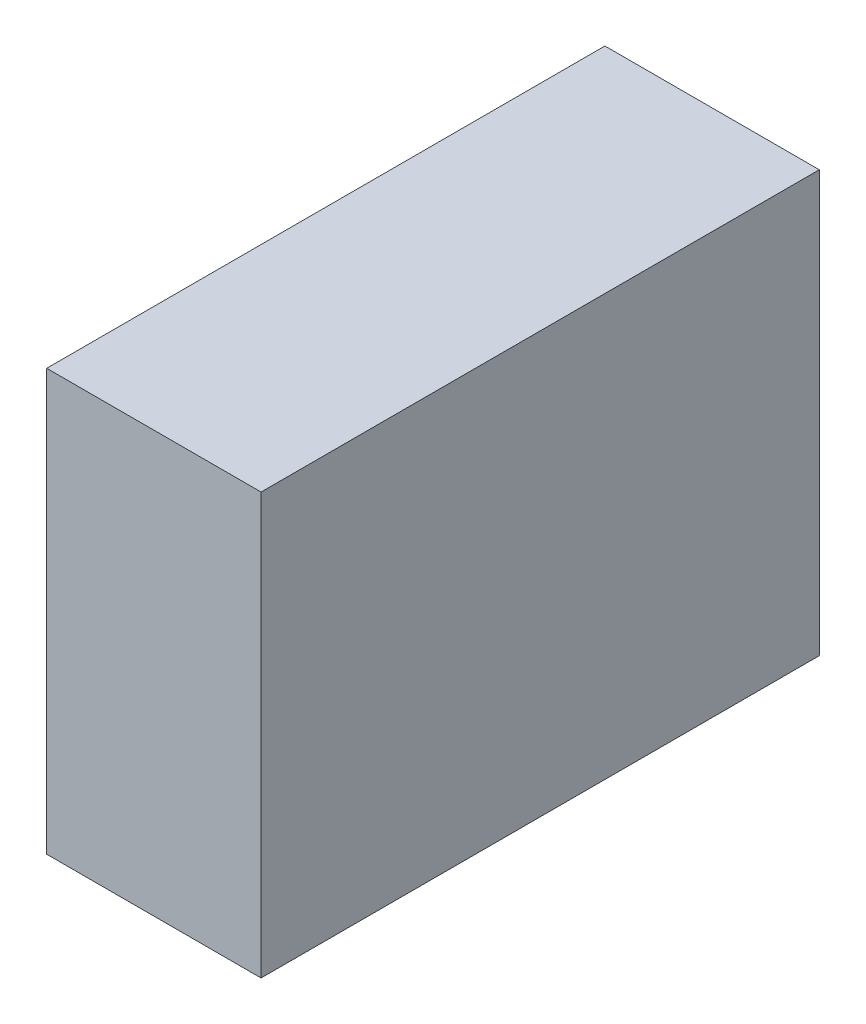
ISO-10303-21;
HEADER;
FILE_DESCRIPTION(('STEP AP214'),'2;1');
FILE_NAME('part.step','',(''),(''),'','','');
FILE_SCHEMA(('AUTOMOTIVE_DESIGN { 1 0 10303 214 1 1 1 1 }'));
ENDSEC;
DATA;
#1=APPLICATION_CONTEXT('core data for automotive mechanical design processes');
#2=APPLICATION_PROTOCOL_DEFINITION('international standard','automotive_design',2000,#1);
#3=PRODUCT_CONTEXT('',#1,'mechanical');
#4=PRODUCT('Part','Part','',(#3));
#5=PRODUCT_RELATED_PRODUCT_CATEGORY('part','',(#4));
#6=PRODUCT_DEFINITION_FORMATION('','',#4);
#7=PRODUCT_DEFINITION_CONTEXT('part definition',#1,'design');
#8=PRODUCT_DEFINITION('design','',#6,#7);
#9=PRODUCT_DEFINITION_SHAPE('','',#8);
#10=(LENGTH_UNIT() NAMED_UNIT(*) SI_UNIT(.MILLI.,.METRE.));
#11=(NAMED_UNIT(*) PLANE_ANGLE_UNIT() SI_UNIT($,.RADIAN.));
#12=(NAMED_UNIT(*) SI_UNIT($,.STERADIAN.) SOLID_ANGLE_UNIT());
#13=UNCERTAINTY_MEASURE_WITH_UNIT(LENGTH_MEASURE(1.E-05),#10,'distance_accuracy_value','');
#14=(GEOMETRIC_REPRESENTATION_CONTEXT(3) GLOBAL_UNCERTAINTY_ASSIGNED_CONTEXT((#13)) GLOBAL_UNIT_ASSIGNED_CONTEXT((#10,
#11,#12)) REPRESENTATION_CONTEXT('',''));
#15=CARTESIAN_POINT('',(0.,0.,0.));
#16=DIRECTION('',(0.,0.,1.));
#17=DIRECTION('',(1.,0.,0.));
#18=AXIS2_PLACEMENT_3D('',#15,#16,#17);
#19=CARTESIAN_POINT('',(0.,0.,25.));
#20=DIRECTION('',(1.,0.,0.));
#21=DIRECTION('',(0.,0.,-1.));
#22=AXIS2_PLACEMENT_3D('',#19,#20,#21);
#23=PLANE('',#22);
#24=DIRECTION('',(0.,-1.,0.));
#25=VECTOR('',#24,1.);
#26=CARTESIAN_POINT('',(0.,0.,0.));
#27=LINE('',#26,#25);
#28=CARTESIAN_POINT('',(0.,18.849,0.));
#29=VERTEX_POINT('',#28);
#30=CARTESIAN_POINT('',(0.,0.,0.));
#31=VERTEX_POINT('',#30);
#32=EDGE_CURVE('E107',#29,#31,#27,.T.);
#33=ORIENTED_EDGE('',*,*,#32,.T.);
#34=DIRECTION('',(0.,0.,-1.));
#35=VECTOR('',#34,1.);
#36=CARTESIAN_POINT('',(0.,0.,25.));
#37=LINE('',#36,#35);
#38=CARTESIAN_POINT('',(0.,0.,25.));
#39=VERTEX_POINT('',#38);
#40=EDGE_CURVE('E11',#39,#31,#37,.T.);
#41=ORIENTED_EDGE('',*,*,#40,.F.);
#42=DIRECTION('',(0.,-1.,0.));
#43=VECTOR('',#42,1.);
#44=CARTESIAN_POINT('',(0.,0.,25.));
#45=LINE('',#44,#43);
#46=CARTESIAN_POINT('',(0.,18.849,25.));
#47=VERTEX_POINT('',#46);
#48=EDGE_CURVE('E91',#47,#39,#45,.T.);
#49=ORIENTED_EDGE('',*,*,#48,.F.);
#50=DIRECTION('',(0.,0.,-1.));
#51=VECTOR('',#50,1.);
#52=CARTESIAN_POINT('',(0.,18.849,25.));
#53=LINE('',#52,#51);
#54=EDGE_CURVE('E103',#47,#29,#53,.T.);
#55=ORIENTED_EDGE('',*,*,#54,.T.);
#56=EDGE_LOOP('',(#33,#41,#49,#55));
#57=FACE_BOUND('',#56,.T.);
#58=ADVANCED_FACE('F39',(#57),#23,.F.);
#59=CARTESIAN_POINT('',(0.,0.,25.));
#60=DIRECTION('',(0.,1.,0.));
#61=DIRECTION('',(-1.,0.,0.));
#62=AXIS2_PLACEMENT_3D('',#59,#60,#61);
#63=PLANE('',#62);
#64=DIRECTION('',(1.,0.,0.));
#65=VECTOR('',#64,1.);
#66=CARTESIAN_POINT('',(0.,0.,0.));
#67=LINE('',#66,#65);
#68=CARTESIAN_POINT('',(9.6,0.,0.));
#69=VERTEX_POINT('',#68);
#70=EDGE_CURVE('E96',#31,#69,#67,.T.);
#71=ORIENTED_EDGE('',*,*,#70,.T.);
#72=DIRECTION('',(0.,0.,-1.));
#73=VECTOR('',#72,1.);
#74=CARTESIAN_POINT('',(9.6,0.,25.));
#75=LINE('',#74,#73);
#76=CARTESIAN_POINT('',(9.6,0.,25.));
#77=VERTEX_POINT('',#76);
#78=EDGE_CURVE('E48',#77,#69,#75,.T.);
#79=ORIENTED_EDGE('',*,*,#78,.F.);
#80=DIRECTION('',(1.,0.,0.));
#81=VECTOR('',#80,1.);
#82=CARTESIAN_POINT('',(0.,0.,25.));
#83=LINE('',#82,#81);
#84=EDGE_CURVE('E86',#39,#77,#83,.T.);
#85=ORIENTED_EDGE('',*,*,#84,.F.);
#86=ORIENTED_EDGE('',*,*,#40,.T.);
#87=EDGE_LOOP('',(#71,#79,#85,#86));
#88=FACE_BOUND('',#87,.T.);
#89=ADVANCED_FACE('F95',(#88),#63,.F.);
#90=CARTESIAN_POINT('',(9.6,0.,25.));
#91=DIRECTION('',(-1.,0.,0.));
#92=DIRECTION('',(0.,-1.,0.));
#93=AXIS2_PLACEMENT_3D('',#90,#91,#92);
#94=PLANE('',#93);
#95=DIRECTION('',(0.,1.,0.));
#96=VECTOR('',#95,1.);
#97=CARTESIAN_POINT('',(9.6,0.,0.));
#98=LINE('',#97,#96);
#99=CARTESIAN_POINT('',(9.59999999999999,18.849,0.));
#100=VERTEX_POINT('',#99);
#101=EDGE_CURVE('E73',#69,#100,#98,.T.);
#102=ORIENTED_EDGE('',*,*,#101,.T.);
#103=DIRECTION('',(0.,0.,-1.));
#104=VECTOR('',#103,1.);
#105=CARTESIAN_POINT('',(9.59999999999999,18.849,25.));
#106=LINE('',#105,#104);
#107=CARTESIAN_POINT('',(9.59999999999999,18.849,25.));
#108=VERTEX_POINT('',#107);
#109=EDGE_CURVE('E98',#108,#100,#106,.T.);
#110=ORIENTED_EDGE('',*,*,#109,.F.);
#111=DIRECTION('',(0.,1.,0.));
#112=VECTOR('',#111,1.);
#113=CARTESIAN_POINT('',(9.6,0.,25.));
#114=LINE('',#113,#112);
#115=EDGE_CURVE('E89',#77,#108,#114,.T.);
#116=ORIENTED_EDGE('',*,*,#115,.F.);
#117=ORIENTED_EDGE('',*,*,#78,.T.);
#118=EDGE_LOOP('',(#102,#110,#116,#117));
#119=FACE_BOUND('',#118,.T.);
#120=ADVANCED_FACE('F99',(#119),#94,.F.);
#121=CARTESIAN_POINT('',(0.,18.849,25.));
#122=DIRECTION('',(0.,-1.,0.));
#123=DIRECTION('',(0.,0.,-1.));
#124=AXIS2_PLACEMENT_3D('',#121,#122,#123);
#125=PLANE('',#124);
#126=DIRECTION('',(-1.,0.,0.));
#127=VECTOR('',#126,1.);
#128=CARTESIAN_POINT('',(0.,18.849,0.));
#129=LINE('',#128,#127);
#130=EDGE_CURVE('E79',#100,#29,#129,.T.);
#131=ORIENTED_EDGE('',*,*,#130,.T.);
#132=ORIENTED_EDGE('',*,*,#54,.F.);
#133=DIRECTION('',(-1.,0.,0.));
#134=VECTOR('',#133,1.);
#135=CARTESIAN_POINT('',(0.,18.849,25.));
#136=LINE('',#135,#134);
#137=EDGE_CURVE('E56',#108,#47,#136,.T.);
#138=ORIENTED_EDGE('',*,*,#137,.F.);
#139=ORIENTED_EDGE('',*,*,#109,.T.);
#140=EDGE_LOOP('',(#131,#132,#138,#139));
#141=FACE_BOUND('',#140,.T.);
#142=ADVANCED_FACE('F120',(#141),#125,.F.);
#143=CARTESIAN_POINT('',(0.,0.,25.));
#144=DIRECTION('',(0.,0.,-1.));
#145=DIRECTION('',(-1.,0.,0.));
#146=AXIS2_PLACEMENT_3D('',#143,#144,#145);
#147=PLANE('',#146);
#148=ORIENTED_EDGE('',*,*,#48,.T.);
#149=ORIENTED_EDGE('',*,*,#84,.T.);
#150=ORIENTED_EDGE('',*,*,#115,.T.);
#151=ORIENTED_EDGE('',*,*,#137,.T.);
#152=EDGE_LOOP('',(#148,#149,#150,#151));
#153=FACE_BOUND('',#152,.T.);
#154=ADVANCED_FACE('F87',(#153),#147,.F.);
#155=CARTESIAN_POINT('',(0.,0.,0.));
#156=DIRECTION('',(0.,0.,-1.));
#157=DIRECTION('',(-1.,0.,0.));
#158=AXIS2_PLACEMENT_3D('',#155,#156,#157);
#159=PLANE('',#158);
#160=ORIENTED_EDGE('',*,*,#32,.F.);
#161=ORIENTED_EDGE('',*,*,#130,.F.);
#162=ORIENTED_EDGE('',*,*,#101,.F.);
#163=ORIENTED_EDGE('',*,*,#70,.F.);
#164=EDGE_LOOP('',(#160,#161,#162,#163));
#165=FACE_BOUND('',#164,.T.);
#166=ADVANCED_FACE('F123',(#165),#159,.T.);
#167=CLOSED_SHELL('',(#58,#89,#120,#142,#154,#166));
#168=MANIFOLD_SOLID_BREP('B2',#167);
#169=ADVANCED_BREP_SHAPE_REPRESENTATION('',(#18,#168),#14);
#170=SHAPE_DEFINITION_REPRESENTATION(#9,#169);
ENDSEC;
END-ISO-10303-21;
